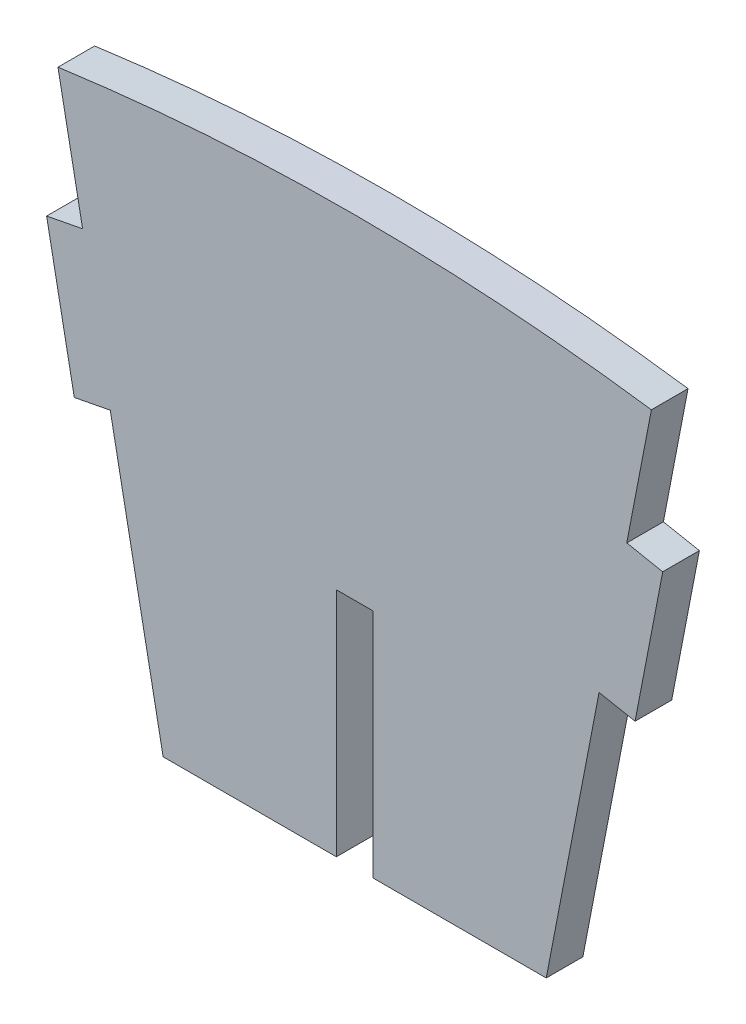
ISO-10303-21;
HEADER;
FILE_DESCRIPTION(('STEP AP214'),'2;1');
FILE_NAME('part.step','',(''),(''),'','','');
FILE_SCHEMA(('AUTOMOTIVE_DESIGN { 1 0 10303 214 1 1 1 1 }'));
ENDSEC;
DATA;
#1=APPLICATION_CONTEXT('core data for automotive mechanical design processes');
#2=APPLICATION_PROTOCOL_DEFINITION('international standard','automotive_design',2000,#1);
#3=PRODUCT_CONTEXT('',#1,'mechanical');
#4=PRODUCT('Part','Part','',(#3));
#5=PRODUCT_RELATED_PRODUCT_CATEGORY('part','',(#4));
#6=PRODUCT_DEFINITION_FORMATION('','',#4);
#7=PRODUCT_DEFINITION_CONTEXT('part definition',#1,'design');
#8=PRODUCT_DEFINITION('design','',#6,#7);
#9=PRODUCT_DEFINITION_SHAPE('','',#8);
#10=(LENGTH_UNIT() NAMED_UNIT(*) SI_UNIT(.MILLI.,.METRE.));
#11=(NAMED_UNIT(*) PLANE_ANGLE_UNIT() SI_UNIT($,.RADIAN.));
#12=(NAMED_UNIT(*) SI_UNIT($,.STERADIAN.) SOLID_ANGLE_UNIT());
#13=UNCERTAINTY_MEASURE_WITH_UNIT(LENGTH_MEASURE(1.E-05),#10,'distance_accuracy_value','');
#14=(GEOMETRIC_REPRESENTATION_CONTEXT(3) GLOBAL_UNCERTAINTY_ASSIGNED_CONTEXT((#13)) GLOBAL_UNIT_ASSIGNED_CONTEXT((#10,
#11,#12)) REPRESENTATION_CONTEXT('',''));
#15=CARTESIAN_POINT('',(0.,0.,0.));
#16=DIRECTION('',(0.,0.,1.));
#17=DIRECTION('',(1.,0.,0.));
#18=AXIS2_PLACEMENT_3D('',#15,#16,#17);
#19=CARTESIAN_POINT('',(0.0853878685347259,8.76561387049004,1.524));
#20=DIRECTION('',(0.,1.,0.));
#21=DIRECTION('',(0.,0.,1.));
#22=AXIS2_PLACEMENT_3D('',#19,#20,#21);
#23=PLANE('',#22);
#24=DIRECTION('',(1.,0.,0.));
#25=VECTOR('',#24,1.);
#26=CARTESIAN_POINT('',(0.0853878685347259,8.76561387049004,0.));
#27=LINE('',#26,#25);
#28=CARTESIAN_POINT('',(0.0853878685347259,8.76561387049004,0.));
#29=VERTEX_POINT('',#28);
#30=CARTESIAN_POINT('',(1.60938786853473,8.76561387049004,0.));
#31=VERTEX_POINT('',#30);
#32=EDGE_CURVE('E176',#29,#31,#27,.T.);
#33=ORIENTED_EDGE('',*,*,#32,.T.);
#34=DIRECTION('',(0.,0.,-1.));
#35=VECTOR('',#34,1.);
#36=CARTESIAN_POINT('',(1.60938786853473,8.76561387049004,1.524));
#37=LINE('',#36,#35);
#38=CARTESIAN_POINT('',(1.60938786853473,8.76561387049004,1.524));
#39=VERTEX_POINT('',#38);
#40=EDGE_CURVE('E11',#39,#31,#37,.T.);
#41=ORIENTED_EDGE('',*,*,#40,.F.);
#42=DIRECTION('',(1.,0.,0.));
#43=VECTOR('',#42,1.);
#44=CARTESIAN_POINT('',(0.0853878685347259,8.76561387049004,1.524));
#45=LINE('',#44,#43);
#46=CARTESIAN_POINT('',(0.0853878685347259,8.76561387049004,1.524));
#47=VERTEX_POINT('',#46);
#48=EDGE_CURVE('E208',#47,#39,#45,.T.);
#49=ORIENTED_EDGE('',*,*,#48,.F.);
#50=DIRECTION('',(0.,0.,-1.));
#51=VECTOR('',#50,1.);
#52=CARTESIAN_POINT('',(0.0853878685347259,8.76561387049004,1.524));
#53=LINE('',#52,#51);
#54=EDGE_CURVE('E172',#47,#29,#53,.T.);
#55=ORIENTED_EDGE('',*,*,#54,.T.);
#56=EDGE_LOOP('',(#33,#41,#49,#55));
#57=FACE_BOUND('',#56,.T.);
#58=ADVANCED_FACE('F32',(#57),#23,.F.);
#59=CARTESIAN_POINT('',(1.60938786853473,8.76561387049004,1.524));
#60=DIRECTION('',(1.,0.,0.));
#61=DIRECTION('',(0.,1.,0.));
#62=AXIS2_PLACEMENT_3D('',#59,#60,#61);
#63=PLANE('',#62);
#64=DIRECTION('',(0.,-1.,0.));
#65=VECTOR('',#64,1.);
#66=CARTESIAN_POINT('',(1.60938786853473,8.76561387049004,0.));
#67=LINE('',#66,#65);
#68=CARTESIAN_POINT('',(1.60938786853473,-0.853085355032588,0.));
#69=VERTEX_POINT('',#68);
#70=EDGE_CURVE('E179',#31,#69,#67,.T.);
#71=ORIENTED_EDGE('',*,*,#70,.T.);
#72=DIRECTION('',(0.,0.,-1.));
#73=VECTOR('',#72,1.);
#74=CARTESIAN_POINT('',(1.60938786853473,-0.853085355032588,1.524));
#75=LINE('',#74,#73);
#76=CARTESIAN_POINT('',(1.60938786853473,-0.853085355032588,1.524));
#77=VERTEX_POINT('',#76);
#78=EDGE_CURVE('E40',#77,#69,#75,.T.);
#79=ORIENTED_EDGE('',*,*,#78,.F.);
#80=DIRECTION('',(0.,-1.,0.));
#81=VECTOR('',#80,1.);
#82=CARTESIAN_POINT('',(1.60938786853473,8.76561387049004,1.524));
#83=LINE('',#82,#81);
#84=EDGE_CURVE('E115',#39,#77,#83,.T.);
#85=ORIENTED_EDGE('',*,*,#84,.F.);
#86=ORIENTED_EDGE('',*,*,#40,.T.);
#87=EDGE_LOOP('',(#71,#79,#85,#86));
#88=FACE_BOUND('',#87,.T.);
#89=ADVANCED_FACE('F306',(#88),#63,.F.);
#90=CARTESIAN_POINT('',(8.81336318885696,-0.853085355032586,1.524));
#91=DIRECTION('',(0.,1.,0.));
#92=DIRECTION('',(-1.,0.,0.));
#93=AXIS2_PLACEMENT_3D('',#90,#91,#92);
#94=PLANE('',#93);
#95=DIRECTION('',(1.,0.,0.));
#96=VECTOR('',#95,1.);
#97=CARTESIAN_POINT('',(8.81336318885696,-0.853085355032586,0.));
#98=LINE('',#97,#96);
#99=CARTESIAN_POINT('',(8.81336318885696,-0.853085355032586,0.));
#100=VERTEX_POINT('',#99);
#101=EDGE_CURVE('E181',#69,#100,#98,.T.);
#102=ORIENTED_EDGE('',*,*,#101,.T.);
#103=DIRECTION('',(0.,0.,-1.));
#104=VECTOR('',#103,1.);
#105=CARTESIAN_POINT('',(8.81336318885696,-0.853085355032586,1.524));
#106=LINE('',#105,#104);
#107=CARTESIAN_POINT('',(8.81336318885696,-0.853085355032586,1.524));
#108=VERTEX_POINT('',#107);
#109=EDGE_CURVE('E239',#108,#100,#106,.T.);
#110=ORIENTED_EDGE('',*,*,#109,.F.);
#111=DIRECTION('',(1.,0.,0.));
#112=VECTOR('',#111,1.);
#113=CARTESIAN_POINT('',(8.81336318885696,-0.853085355032586,1.524));
#114=LINE('',#113,#112);
#115=EDGE_CURVE('E247',#77,#108,#114,.T.);
#116=ORIENTED_EDGE('',*,*,#115,.F.);
#117=ORIENTED_EDGE('',*,*,#78,.T.);
#118=EDGE_LOOP('',(#102,#110,#116,#117));
#119=FACE_BOUND('',#118,.T.);
#120=ADVANCED_FACE('F245',(#119),#94,.F.);
#121=CARTESIAN_POINT('',(8.81336318885696,-0.853085355032586,1.524));
#122=DIRECTION('',(-0.981866202427856,0.189575210747344,0.));
#123=DIRECTION('',(-0.189575210747344,-0.981866202427856,0.));
#124=AXIS2_PLACEMENT_3D('',#121,#122,#123);
#125=PLANE('',#124);
#126=DIRECTION('',(0.189575210747344,0.981866202427856,0.));
#127=VECTOR('',#126,1.);
#128=CARTESIAN_POINT('',(8.81336318885696,-0.853085355032586,0.));
#129=LINE('',#128,#127);
#130=CARTESIAN_POINT('',(11.01119568653,10.5301405401443,0.));
#131=VERTEX_POINT('',#130);
#132=EDGE_CURVE('E183',#100,#131,#129,.T.);
#133=ORIENTED_EDGE('',*,*,#132,.T.);
#134=DIRECTION('',(0.,0.,-1.));
#135=VECTOR('',#134,1.);
#136=CARTESIAN_POINT('',(11.01119568653,10.5301405401443,1.524));
#137=LINE('',#136,#135);
#138=CARTESIAN_POINT('',(11.01119568653,10.5301405401443,1.524));
#139=VERTEX_POINT('',#138);
#140=EDGE_CURVE('E236',#139,#131,#137,.T.);
#141=ORIENTED_EDGE('',*,*,#140,.F.);
#142=DIRECTION('',(0.189575210747344,0.981866202427856,0.));
#143=VECTOR('',#142,1.);
#144=CARTESIAN_POINT('',(8.81336318885696,-0.853085355032586,1.524));
#145=LINE('',#144,#143);
#146=EDGE_CURVE('E265',#108,#139,#145,.T.);
#147=ORIENTED_EDGE('',*,*,#146,.F.);
#148=ORIENTED_EDGE('',*,*,#109,.T.);
#149=EDGE_LOOP('',(#133,#141,#147,#148));
#150=FACE_BOUND('',#149,.T.);
#151=ADVANCED_FACE('F256',(#150),#125,.F.);
#152=CARTESIAN_POINT('',(11.01119568653,10.5301405401443,1.524));
#153=DIRECTION('',(0.189575210747344,0.981866202427856,0.));
#154=DIRECTION('',(-0.981866202427856,0.189575210747344,0.));
#155=AXIS2_PLACEMENT_3D('',#152,#153,#154);
#156=PLANE('',#155);
#157=DIRECTION('',(0.981866202427856,-0.189575210747344,0.));
#158=VECTOR('',#157,1.);
#159=CARTESIAN_POINT('',(11.01119568653,10.5301405401443,0.));
#160=LINE('',#159,#158);
#161=CARTESIAN_POINT('',(12.5075597790301,10.2412279189653,0.));
#162=VERTEX_POINT('',#161);
#163=EDGE_CURVE('E185',#131,#162,#160,.T.);
#164=ORIENTED_EDGE('',*,*,#163,.T.);
#165=DIRECTION('',(0.,0.,-1.));
#166=VECTOR('',#165,1.);
#167=CARTESIAN_POINT('',(12.5075597790301,10.2412279189653,1.524));
#168=LINE('',#167,#166);
#169=CARTESIAN_POINT('',(12.5075597790301,10.2412279189653,1.524));
#170=VERTEX_POINT('',#169);
#171=EDGE_CURVE('E233',#170,#162,#168,.T.);
#172=ORIENTED_EDGE('',*,*,#171,.F.);
#173=DIRECTION('',(0.981866202427856,-0.189575210747344,0.));
#174=VECTOR('',#173,1.);
#175=CARTESIAN_POINT('',(11.01119568653,10.5301405401443,1.524));
#176=LINE('',#175,#174);
#177=EDGE_CURVE('E262',#139,#170,#176,.T.);
#178=ORIENTED_EDGE('',*,*,#177,.F.);
#179=ORIENTED_EDGE('',*,*,#140,.T.);
#180=EDGE_LOOP('',(#164,#172,#178,#179));
#181=FACE_BOUND('',#180,.T.);
#182=ADVANCED_FACE('F260',(#181),#156,.F.);
#183=CARTESIAN_POINT('',(12.5075597790301,10.2412279189653,1.524));
#184=DIRECTION('',(-0.981866202427856,0.189575210747345,0.));
#185=DIRECTION('',(-0.189575210747345,-0.981866202427856,0.));
#186=AXIS2_PLACEMENT_3D('',#183,#184,#185);
#187=PLANE('',#186);
#188=DIRECTION('',(0.189575210747345,0.981866202427856,0.));
#189=VECTOR('',#188,1.);
#190=CARTESIAN_POINT('',(12.5075597790301,10.2412279189653,0.));
#191=LINE('',#190,#189);
#192=CARTESIAN_POINT('',(13.6581513431281,16.200482639732,0.));
#193=VERTEX_POINT('',#192);
#194=EDGE_CURVE('E187',#162,#193,#191,.T.);
#195=ORIENTED_EDGE('',*,*,#194,.T.);
#196=DIRECTION('',(0.,0.,-1.));
#197=VECTOR('',#196,1.);
#198=CARTESIAN_POINT('',(13.6581513431281,16.200482639732,1.524));
#199=LINE('',#198,#197);
#200=CARTESIAN_POINT('',(13.6581513431281,16.200482639732,1.524));
#201=VERTEX_POINT('',#200);
#202=EDGE_CURVE('E230',#201,#193,#199,.T.);
#203=ORIENTED_EDGE('',*,*,#202,.F.);
#204=DIRECTION('',(0.189575210747345,0.981866202427856,0.));
#205=VECTOR('',#204,1.);
#206=CARTESIAN_POINT('',(12.5075597790301,10.2412279189653,1.524));
#207=LINE('',#206,#205);
#208=EDGE_CURVE('E264',#170,#201,#207,.T.);
#209=ORIENTED_EDGE('',*,*,#208,.F.);
#210=ORIENTED_EDGE('',*,*,#171,.T.);
#211=EDGE_LOOP('',(#195,#203,#209,#210));
#212=FACE_BOUND('',#211,.T.);
#213=ADVANCED_FACE('F319',(#212),#187,.F.);
#214=CARTESIAN_POINT('',(13.6581513431281,16.200482639732,1.524));
#215=DIRECTION('',(-0.189575210747344,-0.981866202427856,0.));
#216=DIRECTION('',(0.981866202427856,-0.189575210747344,0.));
#217=AXIS2_PLACEMENT_3D('',#214,#215,#216);
#218=PLANE('',#217);
#219=DIRECTION('',(-0.981866202427856,0.189575210747344,0.));
#220=VECTOR('',#219,1.);
#221=CARTESIAN_POINT('',(13.6581513431281,16.200482639732,0.));
#222=LINE('',#221,#220);
#223=CARTESIAN_POINT('',(12.161787250628,16.489395260911,0.));
#224=VERTEX_POINT('',#223);
#225=EDGE_CURVE('E189',#193,#224,#222,.T.);
#226=ORIENTED_EDGE('',*,*,#225,.T.);
#227=DIRECTION('',(0.,0.,-1.));
#228=VECTOR('',#227,1.);
#229=CARTESIAN_POINT('',(12.161787250628,16.489395260911,1.524));
#230=LINE('',#229,#228);
#231=CARTESIAN_POINT('',(12.161787250628,16.489395260911,1.524));
#232=VERTEX_POINT('',#231);
#233=EDGE_CURVE('E227',#232,#224,#230,.T.);
#234=ORIENTED_EDGE('',*,*,#233,.F.);
#235=DIRECTION('',(-0.981866202427856,0.189575210747344,0.));
#236=VECTOR('',#235,1.);
#237=CARTESIAN_POINT('',(13.6581513431281,16.200482639732,1.524));
#238=LINE('',#237,#236);
#239=EDGE_CURVE('E267',#201,#232,#238,.T.);
#240=ORIENTED_EDGE('',*,*,#239,.F.);
#241=ORIENTED_EDGE('',*,*,#202,.T.);
#242=EDGE_LOOP('',(#226,#234,#240,#241));
#243=FACE_BOUND('',#242,.T.);
#244=ADVANCED_FACE('F322',(#243),#218,.F.);
#245=CARTESIAN_POINT('',(13.0135559097491,20.9009575921952,1.524));
#246=DIRECTION('',(-0.981866202427858,0.189575210747334,0.));
#247=DIRECTION('',(-0.189575210747334,-0.981866202427858,0.));
#248=AXIS2_PLACEMENT_3D('',#245,#246,#247);
#249=PLANE('',#248);
#250=DIRECTION('',(0.189575210747334,0.981866202427858,0.));
#251=VECTOR('',#250,1.);
#252=CARTESIAN_POINT('',(13.0135559097491,20.9009575921952,0.));
#253=LINE('',#252,#251);
#254=CARTESIAN_POINT('',(13.1867026520549,21.797735887524,0.));
#255=VERTEX_POINT('',#254);
#256=EDGE_CURVE('E192',#224,#255,#253,.T.);
#257=ORIENTED_EDGE('',*,*,#256,.T.);
#258=DIRECTION('',(0.,0.,-1.));
#259=VECTOR('',#258,1.);
#260=CARTESIAN_POINT('',(13.1867026520549,21.797735887524,1.524));
#261=LINE('',#260,#259);
#262=CARTESIAN_POINT('',(13.1867026520549,21.797735887524,1.524));
#263=VERTEX_POINT('',#262);
#264=EDGE_CURVE('E224',#263,#255,#261,.T.);
#265=ORIENTED_EDGE('',*,*,#264,.F.);
#266=DIRECTION('',(0.189575210747344,0.981866202427856,0.));
#267=VECTOR('',#266,1.);
#268=CARTESIAN_POINT('',(12.161787250628,16.489395260911,1.524));
#269=LINE('',#268,#267);
#270=EDGE_CURVE('E273',#232,#263,#269,.T.);
#271=ORIENTED_EDGE('',*,*,#270,.F.);
#272=ORIENTED_EDGE('',*,*,#233,.T.);
#273=EDGE_LOOP('',(#257,#265,#271,#272));
#274=FACE_BOUND('',#273,.T.);
#275=ADVANCED_FACE('F326',(#274),#249,.F.);
#276=CARTESIAN_POINT('',(0.847387868534719,-66.7750407623118,1.524));
#277=DIRECTION('',(0.,0.,-1.));
#278=DIRECTION('',(-1.,0.,0.));
#279=AXIS2_PLACEMENT_3D('',#276,#277,#278);
#280=CYLINDRICAL_SURFACE('',#279,89.4281580532021);
#281=CARTESIAN_POINT('',(0.847387868534719,-66.7750407623118,0.));
#282=DIRECTION('',(0.,0.,1.));
#283=DIRECTION('',(-1.,0.,0.));
#284=AXIS2_PLACEMENT_3D('',#281,#282,#283);
#285=CIRCLE('',#284,89.4281580532021);
#286=CARTESIAN_POINT('',(-11.4919269149855,21.797735887524,0.));
#287=VERTEX_POINT('',#286);
#288=EDGE_CURVE('E194',#255,#287,#285,.T.);
#289=ORIENTED_EDGE('',*,*,#288,.T.);
#290=DIRECTION('',(0.,0.,-1.));
#291=VECTOR('',#290,1.);
#292=CARTESIAN_POINT('',(-11.4919269149855,21.797735887524,1.524));
#293=LINE('',#292,#291);
#294=CARTESIAN_POINT('',(-11.4919269149855,21.797735887524,1.524));
#295=VERTEX_POINT('',#294);
#296=EDGE_CURVE('E221',#295,#287,#293,.T.);
#297=ORIENTED_EDGE('',*,*,#296,.F.);
#298=CARTESIAN_POINT('',(0.847387868534719,-66.7750407623118,1.524));
#299=DIRECTION('',(0.,0.,1.));
#300=DIRECTION('',(-1.,0.,0.));
#301=AXIS2_PLACEMENT_3D('',#298,#299,#300);
#302=CIRCLE('',#301,89.4281580532021);
#303=EDGE_CURVE('E275',#263,#295,#302,.T.);
#304=ORIENTED_EDGE('',*,*,#303,.F.);
#305=ORIENTED_EDGE('',*,*,#264,.T.);
#306=EDGE_LOOP('',(#289,#297,#304,#305));
#307=FACE_BOUND('',#306,.T.);
#308=ADVANCED_FACE('F330',(#307),#280,.T.);
#309=CARTESIAN_POINT('',(-10.4670115135586,16.489395260911,1.524));
#310=DIRECTION('',(0.981866202427856,0.189575210747343,0.));
#311=DIRECTION('',(-0.189575210747343,0.981866202427857,0.));
#312=AXIS2_PLACEMENT_3D('',#309,#310,#311);
#313=PLANE('',#312);
#314=DIRECTION('',(0.189575210747343,-0.981866202427856,0.));
#315=VECTOR('',#314,1.);
#316=CARTESIAN_POINT('',(-10.4670115135586,16.489395260911,0.));
#317=LINE('',#316,#315);
#318=CARTESIAN_POINT('',(-10.4670115135586,16.489395260911,0.));
#319=VERTEX_POINT('',#318);
#320=EDGE_CURVE('E197',#287,#319,#317,.T.);
#321=ORIENTED_EDGE('',*,*,#320,.T.);
#322=DIRECTION('',(0.,0.,-1.));
#323=VECTOR('',#322,1.);
#324=CARTESIAN_POINT('',(-10.4670115135586,16.489395260911,1.524));
#325=LINE('',#324,#323);
#326=CARTESIAN_POINT('',(-10.4670115135586,16.489395260911,1.524));
#327=VERTEX_POINT('',#326);
#328=EDGE_CURVE('E218',#327,#319,#325,.T.);
#329=ORIENTED_EDGE('',*,*,#328,.F.);
#330=DIRECTION('',(0.189575210747334,-0.981866202427858,0.));
#331=VECTOR('',#330,1.);
#332=CARTESIAN_POINT('',(-11.3187801726796,20.9009575921952,1.524));
#333=LINE('',#332,#331);
#334=EDGE_CURVE('E277',#295,#327,#333,.T.);
#335=ORIENTED_EDGE('',*,*,#334,.F.);
#336=ORIENTED_EDGE('',*,*,#296,.T.);
#337=EDGE_LOOP('',(#321,#329,#335,#336));
#338=FACE_BOUND('',#337,.T.);
#339=ADVANCED_FACE('F334',(#338),#313,.F.);
#340=CARTESIAN_POINT('',(-11.9633756060586,16.200482639732,1.524));
#341=DIRECTION('',(0.189575210747344,-0.981866202427856,0.));
#342=DIRECTION('',(0.981866202427856,0.189575210747344,0.));
#343=AXIS2_PLACEMENT_3D('',#340,#341,#342);
#344=PLANE('',#343);
#345=DIRECTION('',(-0.981866202427856,-0.189575210747344,0.));
#346=VECTOR('',#345,1.);
#347=CARTESIAN_POINT('',(-11.9633756060586,16.200482639732,0.));
#348=LINE('',#347,#346);
#349=CARTESIAN_POINT('',(-11.9633756060586,16.200482639732,0.));
#350=VERTEX_POINT('',#349);
#351=EDGE_CURVE('E199',#319,#350,#348,.T.);
#352=ORIENTED_EDGE('',*,*,#351,.T.);
#353=DIRECTION('',(0.,0.,-1.));
#354=VECTOR('',#353,1.);
#355=CARTESIAN_POINT('',(-11.9633756060586,16.200482639732,1.524));
#356=LINE('',#355,#354);
#357=CARTESIAN_POINT('',(-11.9633756060586,16.200482639732,1.524));
#358=VERTEX_POINT('',#357);
#359=EDGE_CURVE('E215',#358,#350,#356,.T.);
#360=ORIENTED_EDGE('',*,*,#359,.F.);
#361=DIRECTION('',(-0.981866202427856,-0.189575210747344,0.));
#362=VECTOR('',#361,1.);
#363=CARTESIAN_POINT('',(-11.9633756060586,16.200482639732,1.524));
#364=LINE('',#363,#362);
#365=EDGE_CURVE('E279',#327,#358,#364,.T.);
#366=ORIENTED_EDGE('',*,*,#365,.F.);
#367=ORIENTED_EDGE('',*,*,#328,.T.);
#368=EDGE_LOOP('',(#352,#360,#366,#367));
#369=FACE_BOUND('',#368,.T.);
#370=ADVANCED_FACE('F338',(#369),#344,.F.);
#371=CARTESIAN_POINT('',(-10.8127840419606,10.2412279189653,1.524));
#372=DIRECTION('',(0.981866202427856,0.189575210747344,0.));
#373=DIRECTION('',(-0.189575210747344,0.981866202427856,0.));
#374=AXIS2_PLACEMENT_3D('',#371,#372,#373);
#375=PLANE('',#374);
#376=DIRECTION('',(0.189575210747344,-0.981866202427856,0.));
#377=VECTOR('',#376,1.);
#378=CARTESIAN_POINT('',(-10.8127840419606,10.2412279189653,0.));
#379=LINE('',#378,#377);
#380=CARTESIAN_POINT('',(-10.8127840419606,10.2412279189653,0.));
#381=VERTEX_POINT('',#380);
#382=EDGE_CURVE('E201',#350,#381,#379,.T.);
#383=ORIENTED_EDGE('',*,*,#382,.T.);
#384=DIRECTION('',(0.,0.,-1.));
#385=VECTOR('',#384,1.);
#386=CARTESIAN_POINT('',(-10.8127840419606,10.2412279189653,1.524));
#387=LINE('',#386,#385);
#388=CARTESIAN_POINT('',(-10.8127840419606,10.2412279189653,1.524));
#389=VERTEX_POINT('',#388);
#390=EDGE_CURVE('E212',#389,#381,#387,.T.);
#391=ORIENTED_EDGE('',*,*,#390,.F.);
#392=DIRECTION('',(0.189575210747344,-0.981866202427856,0.));
#393=VECTOR('',#392,1.);
#394=CARTESIAN_POINT('',(-10.8127840419606,10.2412279189653,1.524));
#395=LINE('',#394,#393);
#396=EDGE_CURVE('E281',#358,#389,#395,.T.);
#397=ORIENTED_EDGE('',*,*,#396,.F.);
#398=ORIENTED_EDGE('',*,*,#359,.T.);
#399=EDGE_LOOP('',(#383,#391,#397,#398));
#400=FACE_BOUND('',#399,.T.);
#401=ADVANCED_FACE('F287',(#400),#375,.F.);
#402=CARTESIAN_POINT('',(-9.31641994946056,10.5301405401443,1.524));
#403=DIRECTION('',(-0.189575210747344,0.981866202427856,0.));
#404=DIRECTION('',(-0.981866202427856,-0.189575210747344,0.));
#405=AXIS2_PLACEMENT_3D('',#402,#403,#404);
#406=PLANE('',#405);
#407=DIRECTION('',(0.981866202427856,0.189575210747344,0.));
#408=VECTOR('',#407,1.);
#409=CARTESIAN_POINT('',(-9.31641994946056,10.5301405401443,0.));
#410=LINE('',#409,#408);
#411=CARTESIAN_POINT('',(-9.31641994946056,10.5301405401443,0.));
#412=VERTEX_POINT('',#411);
#413=EDGE_CURVE('E203',#381,#412,#410,.T.);
#414=ORIENTED_EDGE('',*,*,#413,.T.);
#415=DIRECTION('',(0.,0.,-1.));
#416=VECTOR('',#415,1.);
#417=CARTESIAN_POINT('',(-9.31641994946056,10.5301405401443,1.524));
#418=LINE('',#417,#416);
#419=CARTESIAN_POINT('',(-9.31641994946056,10.5301405401443,1.524));
#420=VERTEX_POINT('',#419);
#421=EDGE_CURVE('E167',#420,#412,#418,.T.);
#422=ORIENTED_EDGE('',*,*,#421,.F.);
#423=DIRECTION('',(0.981866202427856,0.189575210747344,0.));
#424=VECTOR('',#423,1.);
#425=CARTESIAN_POINT('',(-9.31641994946056,10.5301405401443,1.524));
#426=LINE('',#425,#424);
#427=EDGE_CURVE('E158',#389,#420,#426,.T.);
#428=ORIENTED_EDGE('',*,*,#427,.F.);
#429=ORIENTED_EDGE('',*,*,#390,.T.);
#430=EDGE_LOOP('',(#414,#422,#428,#429));
#431=FACE_BOUND('',#430,.T.);
#432=ADVANCED_FACE('F291',(#431),#406,.F.);
#433=CARTESIAN_POINT('',(-7.11858745178751,-0.853085355032588,1.524));
#434=DIRECTION('',(0.981866202427856,0.189575210747344,0.));
#435=DIRECTION('',(-0.189575210747344,0.981866202427856,0.));
#436=AXIS2_PLACEMENT_3D('',#433,#434,#435);
#437=PLANE('',#436);
#438=DIRECTION('',(0.189575210747344,-0.981866202427856,0.));
#439=VECTOR('',#438,1.);
#440=CARTESIAN_POINT('',(-7.11858745178751,-0.853085355032588,0.));
#441=LINE('',#440,#439);
#442=CARTESIAN_POINT('',(-7.11858745178751,-0.853085355032588,0.));
#443=VERTEX_POINT('',#442);
#444=EDGE_CURVE('E166',#412,#443,#441,.T.);
#445=ORIENTED_EDGE('',*,*,#444,.T.);
#446=DIRECTION('',(0.,0.,-1.));
#447=VECTOR('',#446,1.);
#448=CARTESIAN_POINT('',(-7.11858745178751,-0.853085355032588,1.524));
#449=LINE('',#448,#447);
#450=CARTESIAN_POINT('',(-7.11858745178751,-0.853085355032588,1.524));
#451=VERTEX_POINT('',#450);
#452=EDGE_CURVE('E163',#451,#443,#449,.T.);
#453=ORIENTED_EDGE('',*,*,#452,.F.);
#454=DIRECTION('',(0.189575210747344,-0.981866202427856,0.));
#455=VECTOR('',#454,1.);
#456=CARTESIAN_POINT('',(-7.11858745178751,-0.853085355032588,1.524));
#457=LINE('',#456,#455);
#458=EDGE_CURVE('E152',#420,#451,#457,.T.);
#459=ORIENTED_EDGE('',*,*,#458,.F.);
#460=ORIENTED_EDGE('',*,*,#421,.T.);
#461=EDGE_LOOP('',(#445,#453,#459,#460));
#462=FACE_BOUND('',#461,.T.);
#463=ADVANCED_FACE('F164',(#462),#437,.F.);
#464=CARTESIAN_POINT('',(0.0853878685347259,-0.853085355032588,1.524));
#465=DIRECTION('',(0.,1.,0.));
#466=DIRECTION('',(-1.,0.,0.));
#467=AXIS2_PLACEMENT_3D('',#464,#465,#466);
#468=PLANE('',#467);
#469=DIRECTION('',(1.,0.,0.));
#470=VECTOR('',#469,1.);
#471=CARTESIAN_POINT('',(0.0853878685347259,-0.853085355032588,0.));
#472=LINE('',#471,#470);
#473=CARTESIAN_POINT('',(0.0853878685347259,-0.853085355032588,0.));
#474=VERTEX_POINT('',#473);
#475=EDGE_CURVE('E101',#443,#474,#472,.T.);
#476=ORIENTED_EDGE('',*,*,#475,.T.);
#477=DIRECTION('',(0.,0.,-1.));
#478=VECTOR('',#477,1.);
#479=CARTESIAN_POINT('',(0.0853878685347259,-0.853085355032588,1.524));
#480=LINE('',#479,#478);
#481=CARTESIAN_POINT('',(0.0853878685347259,-0.853085355032588,1.524));
#482=VERTEX_POINT('',#481);
#483=EDGE_CURVE('E168',#482,#474,#480,.T.);
#484=ORIENTED_EDGE('',*,*,#483,.F.);
#485=DIRECTION('',(1.,0.,0.));
#486=VECTOR('',#485,1.);
#487=CARTESIAN_POINT('',(0.0853878685347259,-0.853085355032588,1.524));
#488=LINE('',#487,#486);
#489=EDGE_CURVE('E156',#451,#482,#488,.T.);
#490=ORIENTED_EDGE('',*,*,#489,.F.);
#491=ORIENTED_EDGE('',*,*,#452,.T.);
#492=EDGE_LOOP('',(#476,#484,#490,#491));
#493=FACE_BOUND('',#492,.T.);
#494=ADVANCED_FACE('F170',(#493),#468,.F.);
#495=CARTESIAN_POINT('',(0.0853878685347259,8.76561387049004,1.524));
#496=DIRECTION('',(-1.,0.,0.));
#497=DIRECTION('',(0.,-1.,0.));
#498=AXIS2_PLACEMENT_3D('',#495,#496,#497);
#499=PLANE('',#498);
#500=DIRECTION('',(0.,1.,0.));
#501=VECTOR('',#500,1.);
#502=CARTESIAN_POINT('',(0.0853878685347259,8.76561387049004,0.));
#503=LINE('',#502,#501);
#504=EDGE_CURVE('E107',#474,#29,#503,.T.);
#505=ORIENTED_EDGE('',*,*,#504,.T.);
#506=ORIENTED_EDGE('',*,*,#54,.F.);
#507=DIRECTION('',(0.,1.,0.));
#508=VECTOR('',#507,1.);
#509=CARTESIAN_POINT('',(0.0853878685347259,8.76561387049004,1.524));
#510=LINE('',#509,#508);
#511=EDGE_CURVE('E48',#482,#47,#510,.T.);
#512=ORIENTED_EDGE('',*,*,#511,.F.);
#513=ORIENTED_EDGE('',*,*,#483,.T.);
#514=EDGE_LOOP('',(#505,#506,#512,#513));
#515=FACE_BOUND('',#514,.T.);
#516=ADVANCED_FACE('F295',(#515),#499,.F.);
#517=CARTESIAN_POINT('',(0.847387868534719,-66.7750407623118,1.524));
#518=DIRECTION('',(0.,0.,-1.));
#519=DIRECTION('',(-1.,0.,0.));
#520=AXIS2_PLACEMENT_3D('',#517,#518,#519);
#521=PLANE('',#520);
#522=ORIENTED_EDGE('',*,*,#48,.T.);
#523=ORIENTED_EDGE('',*,*,#84,.T.);
#524=ORIENTED_EDGE('',*,*,#115,.T.);
#525=ORIENTED_EDGE('',*,*,#146,.T.);
#526=ORIENTED_EDGE('',*,*,#177,.T.);
#527=ORIENTED_EDGE('',*,*,#208,.T.);
#528=ORIENTED_EDGE('',*,*,#239,.T.);
#529=ORIENTED_EDGE('',*,*,#270,.T.);
#530=ORIENTED_EDGE('',*,*,#303,.T.);
#531=ORIENTED_EDGE('',*,*,#334,.T.);
#532=ORIENTED_EDGE('',*,*,#365,.T.);
#533=ORIENTED_EDGE('',*,*,#396,.T.);
#534=ORIENTED_EDGE('',*,*,#427,.T.);
#535=ORIENTED_EDGE('',*,*,#458,.T.);
#536=ORIENTED_EDGE('',*,*,#489,.T.);
#537=ORIENTED_EDGE('',*,*,#511,.T.);
#538=EDGE_LOOP('',(#522,#523,#524,#525,#526,#527,#528,#529,#530,#531,#532,#533,#534,#535,#536,#537));
#539=FACE_BOUND('',#538,.T.);
#540=ADVANCED_FACE('F154',(#539),#521,.F.);
#541=CARTESIAN_POINT('',(0.847387868534719,-66.7750407623118,0.));
#542=DIRECTION('',(0.,0.,-1.));
#543=DIRECTION('',(-1.,0.,0.));
#544=AXIS2_PLACEMENT_3D('',#541,#542,#543);
#545=PLANE('',#544);
#546=ORIENTED_EDGE('',*,*,#32,.F.);
#547=ORIENTED_EDGE('',*,*,#504,.F.);
#548=ORIENTED_EDGE('',*,*,#475,.F.);
#549=ORIENTED_EDGE('',*,*,#444,.F.);
#550=ORIENTED_EDGE('',*,*,#413,.F.);
#551=ORIENTED_EDGE('',*,*,#382,.F.);
#552=ORIENTED_EDGE('',*,*,#351,.F.);
#553=ORIENTED_EDGE('',*,*,#320,.F.);
#554=ORIENTED_EDGE('',*,*,#288,.F.);
#555=ORIENTED_EDGE('',*,*,#256,.F.);
#556=ORIENTED_EDGE('',*,*,#225,.F.);
#557=ORIENTED_EDGE('',*,*,#194,.F.);
#558=ORIENTED_EDGE('',*,*,#163,.F.);
#559=ORIENTED_EDGE('',*,*,#132,.F.);
#560=ORIENTED_EDGE('',*,*,#101,.F.);
#561=ORIENTED_EDGE('',*,*,#70,.F.);
#562=EDGE_LOOP('',(#546,#547,#548,#549,#550,#551,#552,#553,#554,#555,#556,#557,#558,#559,#560,#561));
#563=FACE_BOUND('',#562,.T.);
#564=ADVANCED_FACE('F251',(#563),#545,.T.);
#565=CLOSED_SHELL('',(#58,#89,#120,#151,#182,#213,#244,#275,#308,#339,#370,#401,#432,#463,#494,
#516,#540,#564));
#566=MANIFOLD_SOLID_BREP('B2',#565);
#567=ADVANCED_BREP_SHAPE_REPRESENTATION('',(#18,#566),#14);
#568=SHAPE_DEFINITION_REPRESENTATION(#9,#567);
ENDSEC;
END-ISO-10303-21;
